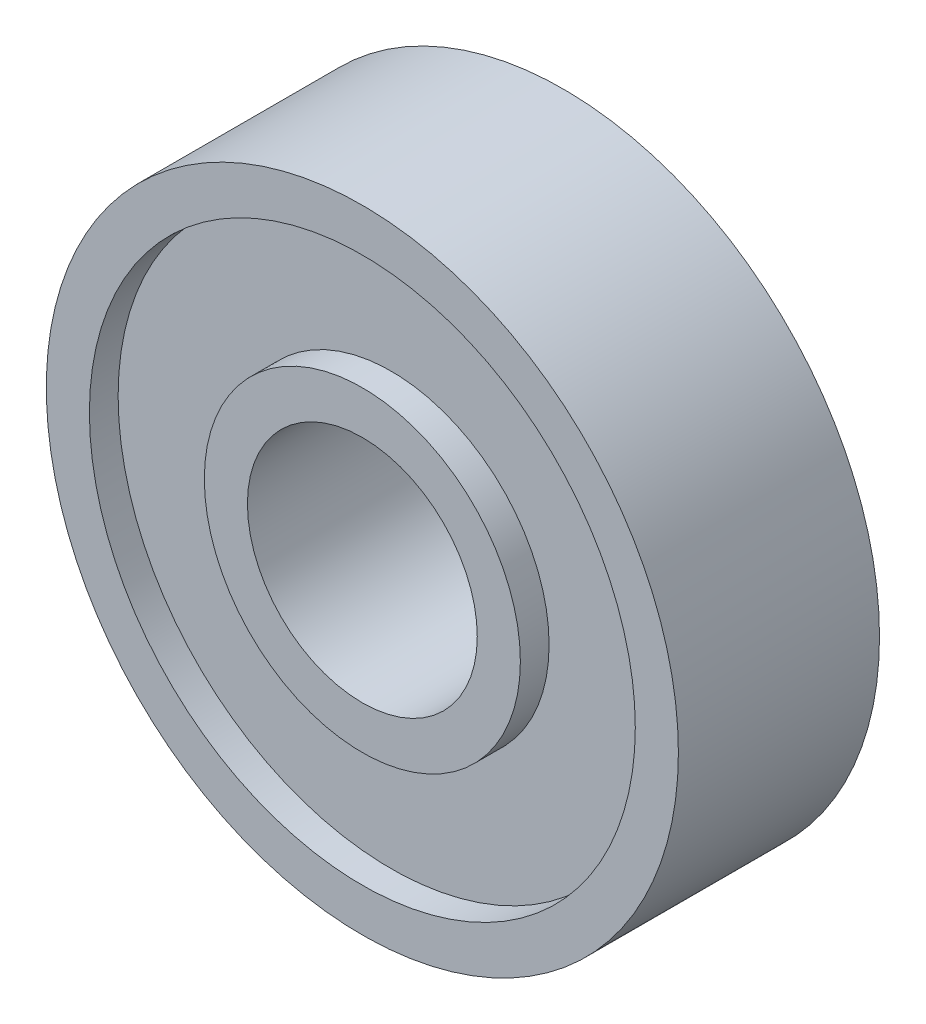
ISO-10303-21;
HEADER;
FILE_DESCRIPTION(('STEP AP214'),'2;1');
FILE_NAME('part.step','',(''),(''),'','','');
FILE_SCHEMA(('AUTOMOTIVE_DESIGN { 1 0 10303 214 1 1 1 1 }'));
ENDSEC;
DATA;
#1=APPLICATION_CONTEXT('core data for automotive mechanical design processes');
#2=APPLICATION_PROTOCOL_DEFINITION('international standard','automotive_design',2000,#1);
#3=PRODUCT_CONTEXT('',#1,'mechanical');
#4=PRODUCT('Part','Part','',(#3));
#5=PRODUCT_RELATED_PRODUCT_CATEGORY('part','',(#4));
#6=PRODUCT_DEFINITION_FORMATION('','',#4);
#7=PRODUCT_DEFINITION_CONTEXT('part definition',#1,'design');
#8=PRODUCT_DEFINITION('design','',#6,#7);
#9=PRODUCT_DEFINITION_SHAPE('','',#8);
#10=(LENGTH_UNIT() NAMED_UNIT(*) SI_UNIT(.MILLI.,.METRE.));
#11=(NAMED_UNIT(*) PLANE_ANGLE_UNIT() SI_UNIT($,.RADIAN.));
#12=(NAMED_UNIT(*) SI_UNIT($,.STERADIAN.) SOLID_ANGLE_UNIT());
#13=UNCERTAINTY_MEASURE_WITH_UNIT(LENGTH_MEASURE(1.E-05),#10,'distance_accuracy_value','');
#14=(GEOMETRIC_REPRESENTATION_CONTEXT(3) GLOBAL_UNCERTAINTY_ASSIGNED_CONTEXT((#13)) GLOBAL_UNIT_ASSIGNED_CONTEXT((#10,
#11,#12)) REPRESENTATION_CONTEXT('',''));
#15=CARTESIAN_POINT('',(0.,0.,0.));
#16=DIRECTION('',(0.,0.,1.));
#17=DIRECTION('',(1.,0.,0.));
#18=AXIS2_PLACEMENT_3D('',#15,#16,#17);
#19=CARTESIAN_POINT('',(0.,0.,0.));
#20=DIRECTION('',(0.,0.,1.));
#21=DIRECTION('',(1.,0.,0.));
#22=AXIS2_PLACEMENT_3D('',#19,#20,#21);
#23=PLANE('',#22);
#24=CARTESIAN_POINT('',(0.,0.,0.));
#25=DIRECTION('',(0.,0.,1.));
#26=DIRECTION('',(1.,0.,0.));
#27=AXIS2_PLACEMENT_3D('',#24,#25,#26);
#28=CIRCLE('',#27,4.);
#29=CARTESIAN_POINT('',(4.,0.,0.));
#30=VERTEX_POINT('',#29);
#31=EDGE_CURVE('E56',#30,#30,#28,.T.);
#32=ORIENTED_EDGE('',*,*,#31,.T.);
#33=EDGE_LOOP('',(#32));
#34=FACE_BOUND('',#33,.T.);
#35=CARTESIAN_POINT('',(0.,0.,0.));
#36=DIRECTION('',(0.,0.,-1.));
#37=DIRECTION('',(-1.,0.,0.));
#38=AXIS2_PLACEMENT_3D('',#35,#36,#37);
#39=CIRCLE('',#38,5.5);
#40=CARTESIAN_POINT('',(-5.5,0.,0.));
#41=VERTEX_POINT('',#40);
#42=EDGE_CURVE('E80',#41,#41,#39,.T.);
#43=ORIENTED_EDGE('',*,*,#42,.T.);
#44=EDGE_LOOP('',(#43));
#45=FACE_BOUND('',#44,.T.);
#46=ADVANCED_FACE('F43',(#34,#45),#23,.F.);
#47=CARTESIAN_POINT('',(0.,0.,7.));
#48=DIRECTION('',(0.,0.,1.));
#49=DIRECTION('',(1.,0.,0.));
#50=AXIS2_PLACEMENT_3D('',#47,#48,#49);
#51=PLANE('',#50);
#52=CARTESIAN_POINT('',(0.,0.,7.));
#53=DIRECTION('',(0.,0.,1.));
#54=DIRECTION('',(1.,0.,0.));
#55=AXIS2_PLACEMENT_3D('',#52,#53,#54);
#56=CIRCLE('',#55,4.);
#57=CARTESIAN_POINT('',(4.,0.,7.));
#58=VERTEX_POINT('',#57);
#59=EDGE_CURVE('E54',#58,#58,#56,.T.);
#60=ORIENTED_EDGE('',*,*,#59,.F.);
#61=EDGE_LOOP('',(#60));
#62=FACE_BOUND('',#61,.T.);
#63=CARTESIAN_POINT('',(0.,0.,7.));
#64=DIRECTION('',(0.,0.,1.));
#65=DIRECTION('',(1.,0.,0.));
#66=AXIS2_PLACEMENT_3D('',#63,#64,#65);
#67=CIRCLE('',#66,5.5);
#68=CARTESIAN_POINT('',(5.5,0.,7.));
#69=VERTEX_POINT('',#68);
#70=EDGE_CURVE('E68',#69,#69,#67,.T.);
#71=ORIENTED_EDGE('',*,*,#70,.T.);
#72=EDGE_LOOP('',(#71));
#73=FACE_BOUND('',#72,.T.);
#74=ADVANCED_FACE('F118',(#62,#73),#51,.T.);
#75=CARTESIAN_POINT('',(0.,0.,7.));
#76=DIRECTION('',(0.,0.,1.));
#77=DIRECTION('',(1.,0.,0.));
#78=AXIS2_PLACEMENT_3D('',#75,#76,#77);
#79=CIRCLE('',#78,9.5);
#80=CARTESIAN_POINT('',(9.5,0.,7.));
#81=VERTEX_POINT('',#80);
#82=EDGE_CURVE('E62',#81,#81,#79,.T.);
#83=ORIENTED_EDGE('',*,*,#82,.F.);
#84=EDGE_LOOP('',(#83));
#85=FACE_BOUND('',#84,.T.);
#86=CARTESIAN_POINT('',(0.,0.,7.));
#87=DIRECTION('',(0.,0.,1.));
#88=DIRECTION('',(1.,0.,0.));
#89=AXIS2_PLACEMENT_3D('',#86,#87,#88);
#90=CIRCLE('',#89,11.);
#91=CARTESIAN_POINT('',(11.,0.,7.));
#92=VERTEX_POINT('',#91);
#93=EDGE_CURVE('E10',#92,#92,#90,.T.);
#94=ORIENTED_EDGE('',*,*,#93,.T.);
#95=EDGE_LOOP('',(#94));
#96=FACE_BOUND('',#95,.T.);
#97=ADVANCED_FACE('F105',(#85,#96),#51,.T.);
#98=CARTESIAN_POINT('',(0.,0.,0.));
#99=DIRECTION('',(0.,0.,-1.));
#100=DIRECTION('',(-1.,0.,0.));
#101=AXIS2_PLACEMENT_3D('',#98,#99,#100);
#102=CIRCLE('',#101,9.5);
#103=CARTESIAN_POINT('',(-9.5,0.,0.));
#104=VERTEX_POINT('',#103);
#105=EDGE_CURVE('E74',#104,#104,#102,.T.);
#106=ORIENTED_EDGE('',*,*,#105,.F.);
#107=EDGE_LOOP('',(#106));
#108=FACE_BOUND('',#107,.T.);
#109=CARTESIAN_POINT('',(0.,0.,0.));
#110=DIRECTION('',(0.,0.,1.));
#111=DIRECTION('',(1.,0.,0.));
#112=AXIS2_PLACEMENT_3D('',#109,#110,#111);
#113=CIRCLE('',#112,11.);
#114=CARTESIAN_POINT('',(11.,0.,0.));
#115=VERTEX_POINT('',#114);
#116=EDGE_CURVE('E47',#115,#115,#113,.T.);
#117=ORIENTED_EDGE('',*,*,#116,.F.);
#118=EDGE_LOOP('',(#117));
#119=FACE_BOUND('',#118,.T.);
#120=ADVANCED_FACE('F102',(#108,#119),#23,.F.);
#121=CARTESIAN_POINT('',(0.,0.,7.));
#122=DIRECTION('',(0.,0.,-1.));
#123=DIRECTION('',(-1.,0.,0.));
#124=AXIS2_PLACEMENT_3D('',#121,#122,#123);
#125=CYLINDRICAL_SURFACE('',#124,11.);
#126=ORIENTED_EDGE('',*,*,#93,.F.);
#127=EDGE_LOOP('',(#126));
#128=FACE_BOUND('',#127,.T.);
#129=ORIENTED_EDGE('',*,*,#116,.T.);
#130=EDGE_LOOP('',(#129));
#131=FACE_BOUND('',#130,.T.);
#132=ADVANCED_FACE('F45',(#128,#131),#125,.T.);
#133=CARTESIAN_POINT('',(0.,0.,7.));
#134=DIRECTION('',(0.,0.,-1.));
#135=DIRECTION('',(-1.,0.,0.));
#136=AXIS2_PLACEMENT_3D('',#133,#134,#135);
#137=CYLINDRICAL_SURFACE('',#136,4.);
#138=ORIENTED_EDGE('',*,*,#59,.T.);
#139=EDGE_LOOP('',(#138));
#140=FACE_BOUND('',#139,.T.);
#141=ORIENTED_EDGE('',*,*,#31,.F.);
#142=EDGE_LOOP('',(#141));
#143=FACE_BOUND('',#142,.T.);
#144=ADVANCED_FACE('F109',(#140,#143),#137,.F.);
#145=CARTESIAN_POINT('',(0.,0.,6.));
#146=DIRECTION('',(0.,0.,1.));
#147=DIRECTION('',(1.,0.,0.));
#148=AXIS2_PLACEMENT_3D('',#145,#146,#147);
#149=CYLINDRICAL_SURFACE('',#148,9.5);
#150=CARTESIAN_POINT('',(0.,0.,6.));
#151=DIRECTION('',(0.,0.,1.));
#152=DIRECTION('',(1.,0.,0.));
#153=AXIS2_PLACEMENT_3D('',#150,#151,#152);
#154=CIRCLE('',#153,9.5);
#155=CARTESIAN_POINT('',(9.5,0.,6.));
#156=VERTEX_POINT('',#155);
#157=EDGE_CURVE('E59',#156,#156,#154,.T.);
#158=ORIENTED_EDGE('',*,*,#157,.F.);
#159=EDGE_LOOP('',(#158));
#160=FACE_BOUND('',#159,.T.);
#161=ORIENTED_EDGE('',*,*,#82,.T.);
#162=EDGE_LOOP('',(#161));
#163=FACE_BOUND('',#162,.T.);
#164=ADVANCED_FACE('F114',(#160,#163),#149,.F.);
#165=CARTESIAN_POINT('',(0.,0.,6.));
#166=DIRECTION('',(0.,0.,1.));
#167=DIRECTION('',(1.,0.,0.));
#168=AXIS2_PLACEMENT_3D('',#165,#166,#167);
#169=PLANE('',#168);
#170=CARTESIAN_POINT('',(0.,0.,6.));
#171=DIRECTION('',(0.,0.,1.));
#172=DIRECTION('',(1.,0.,0.));
#173=AXIS2_PLACEMENT_3D('',#170,#171,#172);
#174=CIRCLE('',#173,5.5);
#175=CARTESIAN_POINT('',(5.5,0.,6.));
#176=VERTEX_POINT('',#175);
#177=EDGE_CURVE('E65',#176,#176,#174,.T.);
#178=ORIENTED_EDGE('',*,*,#177,.F.);
#179=EDGE_LOOP('',(#178));
#180=FACE_BOUND('',#179,.T.);
#181=ORIENTED_EDGE('',*,*,#157,.T.);
#182=EDGE_LOOP('',(#181));
#183=FACE_BOUND('',#182,.T.);
#184=ADVANCED_FACE('F131',(#180,#183),#169,.T.);
#185=CARTESIAN_POINT('',(0.,0.,6.));
#186=DIRECTION('',(0.,0.,1.));
#187=DIRECTION('',(1.,0.,0.));
#188=AXIS2_PLACEMENT_3D('',#185,#186,#187);
#189=CYLINDRICAL_SURFACE('',#188,5.5);
#190=ORIENTED_EDGE('',*,*,#177,.T.);
#191=EDGE_LOOP('',(#190));
#192=FACE_BOUND('',#191,.T.);
#193=ORIENTED_EDGE('',*,*,#70,.F.);
#194=EDGE_LOOP('',(#193));
#195=FACE_BOUND('',#194,.T.);
#196=ADVANCED_FACE('F98',(#192,#195),#189,.T.);
#197=CARTESIAN_POINT('',(0.,0.,1.));
#198=DIRECTION('',(0.,0.,-1.));
#199=DIRECTION('',(-1.,0.,0.));
#200=AXIS2_PLACEMENT_3D('',#197,#198,#199);
#201=CYLINDRICAL_SURFACE('',#200,9.5);
#202=CARTESIAN_POINT('',(0.,0.,1.));
#203=DIRECTION('',(0.,0.,-1.));
#204=DIRECTION('',(-1.,0.,0.));
#205=AXIS2_PLACEMENT_3D('',#202,#203,#204);
#206=CIRCLE('',#205,9.5);
#207=CARTESIAN_POINT('',(-9.5,0.,1.));
#208=VERTEX_POINT('',#207);
#209=EDGE_CURVE('E71',#208,#208,#206,.T.);
#210=ORIENTED_EDGE('',*,*,#209,.F.);
#211=EDGE_LOOP('',(#210));
#212=FACE_BOUND('',#211,.T.);
#213=ORIENTED_EDGE('',*,*,#105,.T.);
#214=EDGE_LOOP('',(#213));
#215=FACE_BOUND('',#214,.T.);
#216=ADVANCED_FACE('F92',(#212,#215),#201,.F.);
#217=CARTESIAN_POINT('',(0.,0.,1.));
#218=DIRECTION('',(0.,0.,-1.));
#219=DIRECTION('',(-1.,0.,0.));
#220=AXIS2_PLACEMENT_3D('',#217,#218,#219);
#221=PLANE('',#220);
#222=CARTESIAN_POINT('',(0.,0.,1.));
#223=DIRECTION('',(0.,0.,-1.));
#224=DIRECTION('',(-1.,0.,0.));
#225=AXIS2_PLACEMENT_3D('',#222,#223,#224);
#226=CIRCLE('',#225,5.5);
#227=CARTESIAN_POINT('',(-5.5,0.,1.));
#228=VERTEX_POINT('',#227);
#229=EDGE_CURVE('E77',#228,#228,#226,.T.);
#230=ORIENTED_EDGE('',*,*,#229,.F.);
#231=EDGE_LOOP('',(#230));
#232=FACE_BOUND('',#231,.T.);
#233=ORIENTED_EDGE('',*,*,#209,.T.);
#234=EDGE_LOOP('',(#233));
#235=FACE_BOUND('',#234,.T.);
#236=ADVANCED_FACE('F89',(#232,#235),#221,.T.);
#237=CARTESIAN_POINT('',(0.,0.,1.));
#238=DIRECTION('',(0.,0.,-1.));
#239=DIRECTION('',(-1.,0.,0.));
#240=AXIS2_PLACEMENT_3D('',#237,#238,#239);
#241=CYLINDRICAL_SURFACE('',#240,5.5);
#242=ORIENTED_EDGE('',*,*,#229,.T.);
#243=EDGE_LOOP('',(#242));
#244=FACE_BOUND('',#243,.T.);
#245=ORIENTED_EDGE('',*,*,#42,.F.);
#246=EDGE_LOOP('',(#245));
#247=FACE_BOUND('',#246,.T.);
#248=ADVANCED_FACE('F86',(#244,#247),#241,.T.);
#249=CLOSED_SHELL('',(#46,#74,#97,#120,#132,#144,#164,#184,#196,#216,#236,#248));
#250=MANIFOLD_SOLID_BREP('B2',#249);
#251=ADVANCED_BREP_SHAPE_REPRESENTATION('',(#18,#250),#14);
#252=SHAPE_DEFINITION_REPRESENTATION(#9,#251);
ENDSEC;
END-ISO-10303-21;
